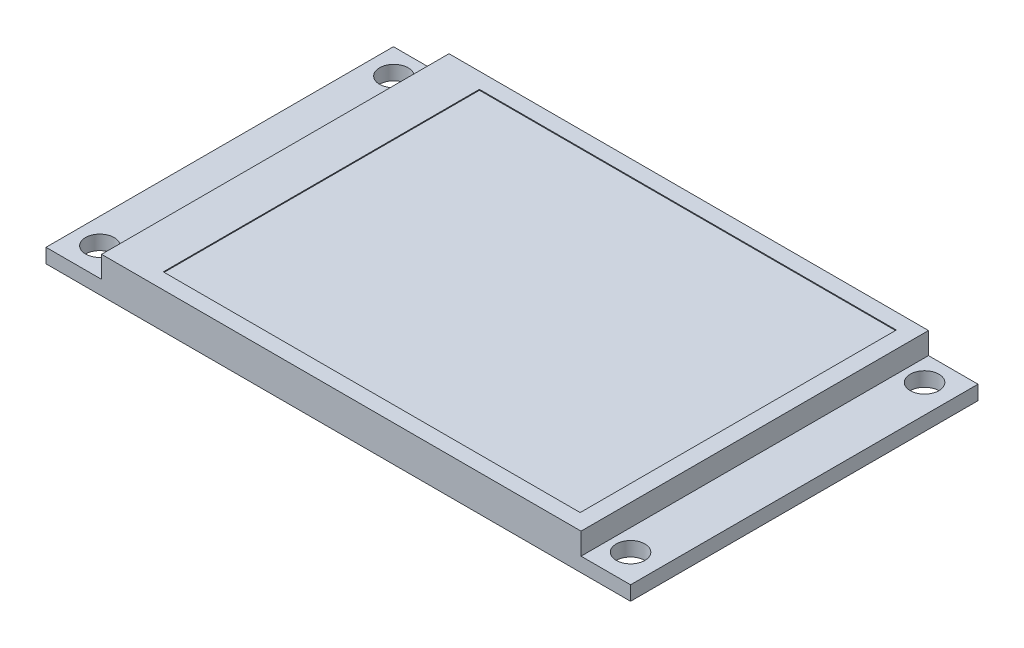
ISO-10303-21;
HEADER;
FILE_DESCRIPTION(('STEP AP214'),'2;1');
FILE_NAME('part.step','',(''),(''),'','','');
FILE_SCHEMA(('AUTOMOTIVE_DESIGN { 1 0 10303 214 1 1 1 1 }'));
ENDSEC;
DATA;
#1=APPLICATION_CONTEXT('core data for automotive mechanical design processes');
#2=APPLICATION_PROTOCOL_DEFINITION('international standard','automotive_design',2000,#1);
#3=PRODUCT_CONTEXT('',#1,'mechanical');
#4=PRODUCT('Part','Part','',(#3));
#5=PRODUCT_RELATED_PRODUCT_CATEGORY('part','',(#4));
#6=PRODUCT_DEFINITION_FORMATION('','',#4);
#7=PRODUCT_DEFINITION_CONTEXT('part definition',#1,'design');
#8=PRODUCT_DEFINITION('design','',#6,#7);
#9=PRODUCT_DEFINITION_SHAPE('','',#8);
#10=(LENGTH_UNIT() NAMED_UNIT(*) SI_UNIT(.MILLI.,.METRE.));
#11=(NAMED_UNIT(*) PLANE_ANGLE_UNIT() SI_UNIT($,.RADIAN.));
#12=(NAMED_UNIT(*) SI_UNIT($,.STERADIAN.) SOLID_ANGLE_UNIT());
#13=UNCERTAINTY_MEASURE_WITH_UNIT(LENGTH_MEASURE(1.E-05),#10,'distance_accuracy_value','');
#14=(GEOMETRIC_REPRESENTATION_CONTEXT(3) GLOBAL_UNCERTAINTY_ASSIGNED_CONTEXT((#13)) GLOBAL_UNIT_ASSIGNED_CONTEXT((#10,
#11,#12)) REPRESENTATION_CONTEXT('',''));
#15=CARTESIAN_POINT('',(0.,0.,0.));
#16=DIRECTION('',(0.,0.,1.));
#17=DIRECTION('',(1.,0.,0.));
#18=AXIS2_PLACEMENT_3D('',#15,#16,#17);
#19=CARTESIAN_POINT('',(0.,1.65,0.));
#20=DIRECTION('',(0.,-1.,0.));
#21=DIRECTION('',(0.,0.,-1.));
#22=AXIS2_PLACEMENT_3D('',#19,#20,#21);
#23=PLANE('',#22);
#24=CARTESIAN_POINT('',(-30.7,1.65,16.75));
#25=DIRECTION('',(0.,1.,0.));
#26=DIRECTION('',(0.,0.,1.));
#27=AXIS2_PLACEMENT_3D('',#24,#25,#26);
#28=CIRCLE('',#27,1.65);
#29=CARTESIAN_POINT('',(-30.7,1.65,18.4));
#30=VERTEX_POINT('',#29);
#31=EDGE_CURVE('E221',#30,#30,#28,.T.);
#32=ORIENTED_EDGE('',*,*,#31,.F.);
#33=EDGE_LOOP('',(#32));
#34=FACE_BOUND('',#33,.T.);
#35=CARTESIAN_POINT('',(-30.7,1.65,-17.1));
#36=DIRECTION('',(0.,1.,0.));
#37=DIRECTION('',(0.,0.,1.));
#38=AXIS2_PLACEMENT_3D('',#35,#36,#37);
#39=CIRCLE('',#38,1.65);
#40=CARTESIAN_POINT('',(-30.7,1.65,-15.45));
#41=VERTEX_POINT('',#40);
#42=EDGE_CURVE('E227',#41,#41,#39,.T.);
#43=ORIENTED_EDGE('',*,*,#42,.F.);
#44=EDGE_LOOP('',(#43));
#45=FACE_BOUND('',#44,.T.);
#46=DIRECTION('',(0.,0.,1.));
#47=VECTOR('',#46,1.);
#48=CARTESIAN_POINT('',(-27.25,1.65,20.));
#49=LINE('',#48,#47);
#50=CARTESIAN_POINT('',(-27.25,1.65,-20.));
#51=VERTEX_POINT('',#50);
#52=CARTESIAN_POINT('',(-27.25,1.65,20.));
#53=VERTEX_POINT('',#52);
#54=EDGE_CURVE('E159',#51,#53,#49,.T.);
#55=ORIENTED_EDGE('',*,*,#54,.F.);
#56=DIRECTION('',(-1.,0.,0.));
#57=VECTOR('',#56,1.);
#58=CARTESIAN_POINT('',(-33.65,1.65,-20.));
#59=LINE('',#58,#57);
#60=CARTESIAN_POINT('',(-33.65,1.65,-20.));
#61=VERTEX_POINT('',#60);
#62=EDGE_CURVE('E236',#51,#61,#59,.T.);
#63=ORIENTED_EDGE('',*,*,#62,.T.);
#64=DIRECTION('',(0.,0.,1.));
#65=VECTOR('',#64,1.);
#66=CARTESIAN_POINT('',(-33.65,1.65,20.));
#67=LINE('',#66,#65);
#68=CARTESIAN_POINT('',(-33.65,1.65,20.));
#69=VERTEX_POINT('',#68);
#70=EDGE_CURVE('E240',#61,#69,#67,.T.);
#71=ORIENTED_EDGE('',*,*,#70,.T.);
#72=DIRECTION('',(1.,0.,0.));
#73=VECTOR('',#72,1.);
#74=CARTESIAN_POINT('',(-33.65,1.65,20.));
#75=LINE('',#74,#73);
#76=EDGE_CURVE('E256',#69,#53,#75,.T.);
#77=ORIENTED_EDGE('',*,*,#76,.T.);
#78=EDGE_LOOP('',(#55,#63,#71,#77));
#79=FACE_BOUND('',#78,.T.);
#80=ADVANCED_FACE('F33',(#34,#45,#79),#23,.F.);
#81=CARTESIAN_POINT('',(30.4,1.65,-17.1));
#82=DIRECTION('',(0.,1.,0.));
#83=DIRECTION('',(0.,0.,1.));
#84=AXIS2_PLACEMENT_3D('',#81,#82,#83);
#85=CIRCLE('',#84,1.65);
#86=CARTESIAN_POINT('',(30.4,1.65,-15.45));
#87=VERTEX_POINT('',#86);
#88=EDGE_CURVE('E208',#87,#87,#85,.T.);
#89=ORIENTED_EDGE('',*,*,#88,.F.);
#90=EDGE_LOOP('',(#89));
#91=FACE_BOUND('',#90,.T.);
#92=CARTESIAN_POINT('',(30.4,1.65,16.75));
#93=DIRECTION('',(0.,1.,0.));
#94=DIRECTION('',(0.,0.,1.));
#95=AXIS2_PLACEMENT_3D('',#92,#93,#94);
#96=CIRCLE('',#95,1.65);
#97=CARTESIAN_POINT('',(30.4,1.65,18.4));
#98=VERTEX_POINT('',#97);
#99=EDGE_CURVE('E215',#98,#98,#96,.T.);
#100=ORIENTED_EDGE('',*,*,#99,.F.);
#101=EDGE_LOOP('',(#100));
#102=FACE_BOUND('',#101,.T.);
#103=DIRECTION('',(0.,0.,-1.));
#104=VECTOR('',#103,1.);
#105=CARTESIAN_POINT('',(27.95,1.65,20.));
#106=LINE('',#105,#104);
#107=CARTESIAN_POINT('',(27.95,1.65,20.));
#108=VERTEX_POINT('',#107);
#109=CARTESIAN_POINT('',(27.95,1.65,-20.));
#110=VERTEX_POINT('',#109);
#111=EDGE_CURVE('E58',#108,#110,#106,.T.);
#112=ORIENTED_EDGE('',*,*,#111,.F.);
#113=CARTESIAN_POINT('',(33.65,1.65,20.));
#114=VERTEX_POINT('',#113);
#115=EDGE_CURVE('E265',#108,#114,#75,.T.);
#116=ORIENTED_EDGE('',*,*,#115,.T.);
#117=DIRECTION('',(0.,0.,-1.));
#118=VECTOR('',#117,1.);
#119=CARTESIAN_POINT('',(33.65,1.65,20.));
#120=LINE('',#119,#118);
#121=CARTESIAN_POINT('',(33.65,1.65,-20.));
#122=VERTEX_POINT('',#121);
#123=EDGE_CURVE('E233',#114,#122,#120,.T.);
#124=ORIENTED_EDGE('',*,*,#123,.T.);
#125=EDGE_CURVE('E246',#122,#110,#59,.T.);
#126=ORIENTED_EDGE('',*,*,#125,.T.);
#127=EDGE_LOOP('',(#112,#116,#124,#126));
#128=FACE_BOUND('',#127,.T.);
#129=ADVANCED_FACE('F291',(#91,#102,#128),#23,.F.);
#130=CARTESIAN_POINT('',(0.,0.,0.));
#131=DIRECTION('',(0.,-1.,0.));
#132=DIRECTION('',(0.,0.,-1.));
#133=AXIS2_PLACEMENT_3D('',#130,#131,#132);
#134=PLANE('',#133);
#135=CARTESIAN_POINT('',(30.4,0.,16.75));
#136=DIRECTION('',(0.,1.,0.));
#137=DIRECTION('',(0.,0.,1.));
#138=AXIS2_PLACEMENT_3D('',#135,#136,#137);
#139=CIRCLE('',#138,1.65);
#140=CARTESIAN_POINT('',(30.4,0.,18.4));
#141=VERTEX_POINT('',#140);
#142=EDGE_CURVE('E213',#141,#141,#139,.T.);
#143=ORIENTED_EDGE('',*,*,#142,.T.);
#144=EDGE_LOOP('',(#143));
#145=FACE_BOUND('',#144,.T.);
#146=CARTESIAN_POINT('',(-30.7,0.,-17.1));
#147=DIRECTION('',(0.,1.,0.));
#148=DIRECTION('',(0.,0.,1.));
#149=AXIS2_PLACEMENT_3D('',#146,#147,#148);
#150=CIRCLE('',#149,1.65);
#151=CARTESIAN_POINT('',(-30.7,0.,-15.45));
#152=VERTEX_POINT('',#151);
#153=EDGE_CURVE('E224',#152,#152,#150,.T.);
#154=ORIENTED_EDGE('',*,*,#153,.T.);
#155=EDGE_LOOP('',(#154));
#156=FACE_BOUND('',#155,.T.);
#157=DIRECTION('',(0.,0.,-1.));
#158=VECTOR('',#157,1.);
#159=CARTESIAN_POINT('',(33.65,0.,20.));
#160=LINE('',#159,#158);
#161=CARTESIAN_POINT('',(33.65,0.,20.));
#162=VERTEX_POINT('',#161);
#163=CARTESIAN_POINT('',(33.65,0.,-20.));
#164=VERTEX_POINT('',#163);
#165=EDGE_CURVE('E230',#162,#164,#160,.T.);
#166=ORIENTED_EDGE('',*,*,#165,.F.);
#167=DIRECTION('',(1.,0.,0.));
#168=VECTOR('',#167,1.);
#169=CARTESIAN_POINT('',(-33.65,0.,20.));
#170=LINE('',#169,#168);
#171=CARTESIAN_POINT('',(-33.65,0.,20.));
#172=VERTEX_POINT('',#171);
#173=EDGE_CURVE('E237',#172,#162,#170,.T.);
#174=ORIENTED_EDGE('',*,*,#173,.F.);
#175=DIRECTION('',(0.,0.,1.));
#176=VECTOR('',#175,1.);
#177=CARTESIAN_POINT('',(-33.65,0.,20.));
#178=LINE('',#177,#176);
#179=CARTESIAN_POINT('',(-33.65,0.,-20.));
#180=VERTEX_POINT('',#179);
#181=EDGE_CURVE('E258',#180,#172,#178,.T.);
#182=ORIENTED_EDGE('',*,*,#181,.F.);
#183=DIRECTION('',(-1.,0.,0.));
#184=VECTOR('',#183,1.);
#185=CARTESIAN_POINT('',(-33.65,0.,-20.));
#186=LINE('',#185,#184);
#187=EDGE_CURVE('E260',#164,#180,#186,.T.);
#188=ORIENTED_EDGE('',*,*,#187,.F.);
#189=EDGE_LOOP('',(#166,#174,#182,#188));
#190=FACE_BOUND('',#189,.T.);
#191=CARTESIAN_POINT('',(-30.7,0.,16.75));
#192=DIRECTION('',(0.,1.,0.));
#193=DIRECTION('',(0.,0.,1.));
#194=AXIS2_PLACEMENT_3D('',#191,#192,#193);
#195=CIRCLE('',#194,1.65);
#196=CARTESIAN_POINT('',(-30.7,0.,18.4));
#197=VERTEX_POINT('',#196);
#198=EDGE_CURVE('E218',#197,#197,#195,.T.);
#199=ORIENTED_EDGE('',*,*,#198,.T.);
#200=EDGE_LOOP('',(#199));
#201=FACE_BOUND('',#200,.T.);
#202=CARTESIAN_POINT('',(30.4,0.,-17.1));
#203=DIRECTION('',(0.,1.,0.));
#204=DIRECTION('',(0.,0.,1.));
#205=AXIS2_PLACEMENT_3D('',#202,#203,#204);
#206=CIRCLE('',#205,1.65);
#207=CARTESIAN_POINT('',(30.4,0.,-15.45));
#208=VERTEX_POINT('',#207);
#209=EDGE_CURVE('E203',#208,#208,#206,.T.);
#210=ORIENTED_EDGE('',*,*,#209,.T.);
#211=EDGE_LOOP('',(#210));
#212=FACE_BOUND('',#211,.T.);
#213=ADVANCED_FACE('F297',(#145,#156,#190,#201,#212),#134,.T.);
#214=CARTESIAN_POINT('',(33.65,1.65,20.));
#215=DIRECTION('',(-1.,0.,0.));
#216=DIRECTION('',(0.,0.,1.));
#217=AXIS2_PLACEMENT_3D('',#214,#215,#216);
#218=PLANE('',#217);
#219=ORIENTED_EDGE('',*,*,#165,.T.);
#220=DIRECTION('',(0.,-1.,0.));
#221=VECTOR('',#220,1.);
#222=CARTESIAN_POINT('',(33.65,1.65,-20.));
#223=LINE('',#222,#221);
#224=EDGE_CURVE('E11',#122,#164,#223,.T.);
#225=ORIENTED_EDGE('',*,*,#224,.F.);
#226=ORIENTED_EDGE('',*,*,#123,.F.);
#227=DIRECTION('',(0.,-1.,0.));
#228=VECTOR('',#227,1.);
#229=CARTESIAN_POINT('',(33.65,1.65,20.));
#230=LINE('',#229,#228);
#231=EDGE_CURVE('E253',#114,#162,#230,.T.);
#232=ORIENTED_EDGE('',*,*,#231,.T.);
#233=EDGE_LOOP('',(#219,#225,#226,#232));
#234=FACE_BOUND('',#233,.T.);
#235=ADVANCED_FACE('F35',(#234),#218,.F.);
#236=CARTESIAN_POINT('',(-33.65,1.65,-20.));
#237=DIRECTION('',(0.,0.,1.));
#238=DIRECTION('',(1.,0.,0.));
#239=AXIS2_PLACEMENT_3D('',#236,#237,#238);
#240=PLANE('',#239);
#241=ORIENTED_EDGE('',*,*,#187,.T.);
#242=DIRECTION('',(0.,-1.,0.));
#243=VECTOR('',#242,1.);
#244=CARTESIAN_POINT('',(-33.65,1.65,-20.));
#245=LINE('',#244,#243);
#246=EDGE_CURVE('E42',#61,#180,#245,.T.);
#247=ORIENTED_EDGE('',*,*,#246,.F.);
#248=ORIENTED_EDGE('',*,*,#62,.F.);
#249=DIRECTION('',(0.,-1.,0.));
#250=VECTOR('',#249,1.);
#251=CARTESIAN_POINT('',(-27.25,4.15,-20.));
#252=LINE('',#251,#250);
#253=CARTESIAN_POINT('',(-27.25,4.15,-20.));
#254=VERTEX_POINT('',#253);
#255=EDGE_CURVE('E172',#254,#51,#252,.T.);
#256=ORIENTED_EDGE('',*,*,#255,.F.);
#257=DIRECTION('',(-1.,0.,0.));
#258=VECTOR('',#257,1.);
#259=CARTESIAN_POINT('',(-27.25,4.15,-20.));
#260=LINE('',#259,#258);
#261=CARTESIAN_POINT('',(27.95,4.15,-20.));
#262=VERTEX_POINT('',#261);
#263=EDGE_CURVE('E170',#262,#254,#260,.T.);
#264=ORIENTED_EDGE('',*,*,#263,.F.);
#265=DIRECTION('',(0.,-1.,0.));
#266=VECTOR('',#265,1.);
#267=CARTESIAN_POINT('',(27.95,4.15,-20.));
#268=LINE('',#267,#266);
#269=EDGE_CURVE('E183',#262,#110,#268,.T.);
#270=ORIENTED_EDGE('',*,*,#269,.T.);
#271=ORIENTED_EDGE('',*,*,#125,.F.);
#272=ORIENTED_EDGE('',*,*,#224,.T.);
#273=EDGE_LOOP('',(#241,#247,#248,#256,#264,#270,#271,#272));
#274=FACE_BOUND('',#273,.T.);
#275=ADVANCED_FACE('F287',(#274),#240,.F.);
#276=CARTESIAN_POINT('',(-33.65,1.65,20.));
#277=DIRECTION('',(1.,0.,0.));
#278=DIRECTION('',(0.,0.,-1.));
#279=AXIS2_PLACEMENT_3D('',#276,#277,#278);
#280=PLANE('',#279);
#281=ORIENTED_EDGE('',*,*,#181,.T.);
#282=DIRECTION('',(0.,-1.,0.));
#283=VECTOR('',#282,1.);
#284=CARTESIAN_POINT('',(-33.65,1.65,20.));
#285=LINE('',#284,#283);
#286=EDGE_CURVE('E250',#69,#172,#285,.T.);
#287=ORIENTED_EDGE('',*,*,#286,.F.);
#288=ORIENTED_EDGE('',*,*,#70,.F.);
#289=ORIENTED_EDGE('',*,*,#246,.T.);
#290=EDGE_LOOP('',(#281,#287,#288,#289));
#291=FACE_BOUND('',#290,.T.);
#292=ADVANCED_FACE('F273',(#291),#280,.F.);
#293=CARTESIAN_POINT('',(-33.65,1.65,20.));
#294=DIRECTION('',(0.,0.,-1.));
#295=DIRECTION('',(-1.,0.,0.));
#296=AXIS2_PLACEMENT_3D('',#293,#294,#295);
#297=PLANE('',#296);
#298=ORIENTED_EDGE('',*,*,#173,.T.);
#299=ORIENTED_EDGE('',*,*,#231,.F.);
#300=ORIENTED_EDGE('',*,*,#115,.F.);
#301=DIRECTION('',(0.,-1.,0.));
#302=VECTOR('',#301,1.);
#303=CARTESIAN_POINT('',(27.95,4.15,20.));
#304=LINE('',#303,#302);
#305=CARTESIAN_POINT('',(27.95,4.15,20.));
#306=VERTEX_POINT('',#305);
#307=EDGE_CURVE('E188',#306,#108,#304,.T.);
#308=ORIENTED_EDGE('',*,*,#307,.F.);
#309=DIRECTION('',(1.,0.,0.));
#310=VECTOR('',#309,1.);
#311=CARTESIAN_POINT('',(-27.25,4.15,20.));
#312=LINE('',#311,#310);
#313=CARTESIAN_POINT('',(-27.25,4.15,20.));
#314=VERTEX_POINT('',#313);
#315=EDGE_CURVE('E166',#314,#306,#312,.T.);
#316=ORIENTED_EDGE('',*,*,#315,.F.);
#317=DIRECTION('',(0.,-1.,0.));
#318=VECTOR('',#317,1.);
#319=CARTESIAN_POINT('',(-27.25,4.15,20.));
#320=LINE('',#319,#318);
#321=EDGE_CURVE('E194',#314,#53,#320,.T.);
#322=ORIENTED_EDGE('',*,*,#321,.T.);
#323=ORIENTED_EDGE('',*,*,#76,.F.);
#324=ORIENTED_EDGE('',*,*,#286,.T.);
#325=EDGE_LOOP('',(#298,#299,#300,#308,#316,#322,#323,#324));
#326=FACE_BOUND('',#325,.T.);
#327=ADVANCED_FACE('F276',(#326),#297,.F.);
#328=CARTESIAN_POINT('',(-30.7,1.65,-17.1));
#329=DIRECTION('',(0.,-1.,0.));
#330=DIRECTION('',(0.,0.,-1.));
#331=AXIS2_PLACEMENT_3D('',#328,#329,#330);
#332=CYLINDRICAL_SURFACE('',#331,1.65);
#333=ORIENTED_EDGE('',*,*,#42,.T.);
#334=EDGE_LOOP('',(#333));
#335=FACE_BOUND('',#334,.T.);
#336=ORIENTED_EDGE('',*,*,#153,.F.);
#337=EDGE_LOOP('',(#336));
#338=FACE_BOUND('',#337,.T.);
#339=ADVANCED_FACE('F278',(#335,#338),#332,.F.);
#340=CARTESIAN_POINT('',(-30.7,1.65,16.75));
#341=DIRECTION('',(0.,-1.,0.));
#342=DIRECTION('',(0.,0.,-1.));
#343=AXIS2_PLACEMENT_3D('',#340,#341,#342);
#344=CYLINDRICAL_SURFACE('',#343,1.65);
#345=ORIENTED_EDGE('',*,*,#31,.T.);
#346=EDGE_LOOP('',(#345));
#347=FACE_BOUND('',#346,.T.);
#348=ORIENTED_EDGE('',*,*,#198,.F.);
#349=EDGE_LOOP('',(#348));
#350=FACE_BOUND('',#349,.T.);
#351=ADVANCED_FACE('F284',(#347,#350),#344,.F.);
#352=CARTESIAN_POINT('',(30.4,1.65,16.75));
#353=DIRECTION('',(0.,-1.,0.));
#354=DIRECTION('',(0.,0.,-1.));
#355=AXIS2_PLACEMENT_3D('',#352,#353,#354);
#356=CYLINDRICAL_SURFACE('',#355,1.65);
#357=ORIENTED_EDGE('',*,*,#99,.T.);
#358=EDGE_LOOP('',(#357));
#359=FACE_BOUND('',#358,.T.);
#360=ORIENTED_EDGE('',*,*,#142,.F.);
#361=EDGE_LOOP('',(#360));
#362=FACE_BOUND('',#361,.T.);
#363=ADVANCED_FACE('F317',(#359,#362),#356,.F.);
#364=CARTESIAN_POINT('',(30.4,1.65,-17.1));
#365=DIRECTION('',(0.,-1.,0.));
#366=DIRECTION('',(0.,0.,-1.));
#367=AXIS2_PLACEMENT_3D('',#364,#365,#366);
#368=CYLINDRICAL_SURFACE('',#367,1.65);
#369=ORIENTED_EDGE('',*,*,#88,.T.);
#370=EDGE_LOOP('',(#369));
#371=FACE_BOUND('',#370,.T.);
#372=ORIENTED_EDGE('',*,*,#209,.F.);
#373=EDGE_LOOP('',(#372));
#374=FACE_BOUND('',#373,.T.);
#375=ADVANCED_FACE('F322',(#371,#374),#368,.F.);
#376=CARTESIAN_POINT('',(-27.25,4.15,20.));
#377=DIRECTION('',(1.,0.,0.));
#378=DIRECTION('',(0.,0.,-1.));
#379=AXIS2_PLACEMENT_3D('',#376,#377,#378);
#380=PLANE('',#379);
#381=ORIENTED_EDGE('',*,*,#54,.T.);
#382=ORIENTED_EDGE('',*,*,#321,.F.);
#383=DIRECTION('',(0.,0.,1.));
#384=VECTOR('',#383,1.);
#385=CARTESIAN_POINT('',(-27.25,4.15,20.));
#386=LINE('',#385,#384);
#387=EDGE_CURVE('E163',#254,#314,#386,.T.);
#388=ORIENTED_EDGE('',*,*,#387,.F.);
#389=ORIENTED_EDGE('',*,*,#255,.T.);
#390=EDGE_LOOP('',(#381,#382,#388,#389));
#391=FACE_BOUND('',#390,.T.);
#392=ADVANCED_FACE('F328',(#391),#380,.F.);
#393=CARTESIAN_POINT('',(27.95,4.15,20.));
#394=DIRECTION('',(-1.,0.,0.));
#395=DIRECTION('',(0.,0.,1.));
#396=AXIS2_PLACEMENT_3D('',#393,#394,#395);
#397=PLANE('',#396);
#398=ORIENTED_EDGE('',*,*,#111,.T.);
#399=ORIENTED_EDGE('',*,*,#269,.F.);
#400=DIRECTION('',(0.,0.,-1.));
#401=VECTOR('',#400,1.);
#402=CARTESIAN_POINT('',(27.95,4.15,20.));
#403=LINE('',#402,#401);
#404=EDGE_CURVE('E168',#306,#262,#403,.T.);
#405=ORIENTED_EDGE('',*,*,#404,.F.);
#406=ORIENTED_EDGE('',*,*,#307,.T.);
#407=EDGE_LOOP('',(#398,#399,#405,#406));
#408=FACE_BOUND('',#407,.T.);
#409=ADVANCED_FACE('F332',(#408),#397,.F.);
#410=CARTESIAN_POINT('',(0.,4.15,0.));
#411=DIRECTION('',(0.,-1.,0.));
#412=DIRECTION('',(0.,0.,-1.));
#413=AXIS2_PLACEMENT_3D('',#410,#411,#412);
#414=PLANE('',#413);
#415=DIRECTION('',(1.,0.,0.));
#416=VECTOR('',#415,1.);
#417=CARTESIAN_POINT('',(-21.95,4.15,18.2));
#418=LINE('',#417,#416);
#419=CARTESIAN_POINT('',(-21.95,4.15,18.2));
#420=VERTEX_POINT('',#419);
#421=CARTESIAN_POINT('',(26.05,4.15,18.2));
#422=VERTEX_POINT('',#421);
#423=EDGE_CURVE('E153',#420,#422,#418,.T.);
#424=ORIENTED_EDGE('',*,*,#423,.F.);
#425=DIRECTION('',(0.,0.,1.));
#426=VECTOR('',#425,1.);
#427=CARTESIAN_POINT('',(-21.95,4.15,-18.2));
#428=LINE('',#427,#426);
#429=CARTESIAN_POINT('',(-21.95,4.15,-18.2));
#430=VERTEX_POINT('',#429);
#431=EDGE_CURVE('E50',#430,#420,#428,.T.);
#432=ORIENTED_EDGE('',*,*,#431,.F.);
#433=DIRECTION('',(-1.,0.,0.));
#434=VECTOR('',#433,1.);
#435=CARTESIAN_POINT('',(-21.95,4.15,-18.2));
#436=LINE('',#435,#434);
#437=CARTESIAN_POINT('',(26.05,4.15,-18.2));
#438=VERTEX_POINT('',#437);
#439=EDGE_CURVE('E144',#438,#430,#436,.T.);
#440=ORIENTED_EDGE('',*,*,#439,.F.);
#441=DIRECTION('',(0.,0.,-1.));
#442=VECTOR('',#441,1.);
#443=CARTESIAN_POINT('',(26.05,4.15,-18.2));
#444=LINE('',#443,#442);
#445=EDGE_CURVE('E147',#422,#438,#444,.T.);
#446=ORIENTED_EDGE('',*,*,#445,.F.);
#447=EDGE_LOOP('',(#424,#432,#440,#446));
#448=FACE_BOUND('',#447,.T.);
#449=ORIENTED_EDGE('',*,*,#387,.T.);
#450=ORIENTED_EDGE('',*,*,#315,.T.);
#451=ORIENTED_EDGE('',*,*,#404,.T.);
#452=ORIENTED_EDGE('',*,*,#263,.T.);
#453=EDGE_LOOP('',(#449,#450,#451,#452));
#454=FACE_BOUND('',#453,.T.);
#455=ADVANCED_FACE('F335',(#448,#454),#414,.F.);
#456=CARTESIAN_POINT('',(-21.95,4.05,-18.2));
#457=DIRECTION('',(-1.,0.,0.));
#458=DIRECTION('',(0.,0.,1.));
#459=AXIS2_PLACEMENT_3D('',#456,#457,#458);
#460=PLANE('',#459);
#461=ORIENTED_EDGE('',*,*,#431,.T.);
#462=DIRECTION('',(0.,1.,0.));
#463=VECTOR('',#462,1.);
#464=CARTESIAN_POINT('',(-21.95,4.05,18.2));
#465=LINE('',#464,#463);
#466=CARTESIAN_POINT('',(-21.95,4.05,18.2));
#467=VERTEX_POINT('',#466);
#468=EDGE_CURVE('E122',#467,#420,#465,.T.);
#469=ORIENTED_EDGE('',*,*,#468,.F.);
#470=DIRECTION('',(0.,0.,1.));
#471=VECTOR('',#470,1.);
#472=CARTESIAN_POINT('',(-21.95,4.05,-18.2));
#473=LINE('',#472,#471);
#474=CARTESIAN_POINT('',(-21.95,4.05,-18.2));
#475=VERTEX_POINT('',#474);
#476=EDGE_CURVE('E126',#475,#467,#473,.T.);
#477=ORIENTED_EDGE('',*,*,#476,.F.);
#478=DIRECTION('',(0.,1.,0.));
#479=VECTOR('',#478,1.);
#480=CARTESIAN_POINT('',(-21.95,4.05,-18.2));
#481=LINE('',#480,#479);
#482=EDGE_CURVE('E157',#475,#430,#481,.T.);
#483=ORIENTED_EDGE('',*,*,#482,.T.);
#484=EDGE_LOOP('',(#461,#469,#477,#483));
#485=FACE_BOUND('',#484,.T.);
#486=ADVANCED_FACE('F124',(#485),#460,.F.);
#487=CARTESIAN_POINT('',(-21.95,4.05,-18.2));
#488=DIRECTION('',(0.,0.,-1.));
#489=DIRECTION('',(-1.,0.,0.));
#490=AXIS2_PLACEMENT_3D('',#487,#488,#489);
#491=PLANE('',#490);
#492=ORIENTED_EDGE('',*,*,#439,.T.);
#493=ORIENTED_EDGE('',*,*,#482,.F.);
#494=DIRECTION('',(-1.,0.,0.));
#495=VECTOR('',#494,1.);
#496=CARTESIAN_POINT('',(-21.95,4.05,-18.2));
#497=LINE('',#496,#495);
#498=CARTESIAN_POINT('',(26.05,4.05,-18.2));
#499=VERTEX_POINT('',#498);
#500=EDGE_CURVE('E132',#499,#475,#497,.T.);
#501=ORIENTED_EDGE('',*,*,#500,.F.);
#502=DIRECTION('',(0.,1.,0.));
#503=VECTOR('',#502,1.);
#504=CARTESIAN_POINT('',(26.05,4.05,-18.2));
#505=LINE('',#504,#503);
#506=EDGE_CURVE('E160',#499,#438,#505,.T.);
#507=ORIENTED_EDGE('',*,*,#506,.T.);
#508=EDGE_LOOP('',(#492,#493,#501,#507));
#509=FACE_BOUND('',#508,.T.);
#510=ADVANCED_FACE('F342',(#509),#491,.F.);
#511=CARTESIAN_POINT('',(26.05,4.05,-18.2));
#512=DIRECTION('',(1.,0.,0.));
#513=DIRECTION('',(0.,0.,-1.));
#514=AXIS2_PLACEMENT_3D('',#511,#512,#513);
#515=PLANE('',#514);
#516=ORIENTED_EDGE('',*,*,#445,.T.);
#517=ORIENTED_EDGE('',*,*,#506,.F.);
#518=DIRECTION('',(0.,0.,-1.));
#519=VECTOR('',#518,1.);
#520=CARTESIAN_POINT('',(26.05,4.05,-18.2));
#521=LINE('',#520,#519);
#522=CARTESIAN_POINT('',(26.05,4.05,18.2));
#523=VERTEX_POINT('',#522);
#524=EDGE_CURVE('E140',#523,#499,#521,.T.);
#525=ORIENTED_EDGE('',*,*,#524,.F.);
#526=DIRECTION('',(0.,1.,0.));
#527=VECTOR('',#526,1.);
#528=CARTESIAN_POINT('',(26.05,4.05,18.2));
#529=LINE('',#528,#527);
#530=EDGE_CURVE('E131',#523,#422,#529,.T.);
#531=ORIENTED_EDGE('',*,*,#530,.T.);
#532=EDGE_LOOP('',(#516,#517,#525,#531));
#533=FACE_BOUND('',#532,.T.);
#534=ADVANCED_FACE('F345',(#533),#515,.F.);
#535=CARTESIAN_POINT('',(-21.95,4.05,18.2));
#536=DIRECTION('',(0.,0.,1.));
#537=DIRECTION('',(1.,0.,0.));
#538=AXIS2_PLACEMENT_3D('',#535,#536,#537);
#539=PLANE('',#538);
#540=ORIENTED_EDGE('',*,*,#423,.T.);
#541=ORIENTED_EDGE('',*,*,#530,.F.);
#542=DIRECTION('',(1.,0.,0.));
#543=VECTOR('',#542,1.);
#544=CARTESIAN_POINT('',(-21.95,4.05,18.2));
#545=LINE('',#544,#543);
#546=EDGE_CURVE('E135',#467,#523,#545,.T.);
#547=ORIENTED_EDGE('',*,*,#546,.F.);
#548=ORIENTED_EDGE('',*,*,#468,.T.);
#549=EDGE_LOOP('',(#540,#541,#547,#548));
#550=FACE_BOUND('',#549,.T.);
#551=ADVANCED_FACE('F136',(#550),#539,.F.);
#552=CARTESIAN_POINT('',(0.,4.05,0.));
#553=DIRECTION('',(0.,1.,0.));
#554=DIRECTION('',(0.,0.,1.));
#555=AXIS2_PLACEMENT_3D('',#552,#553,#554);
#556=PLANE('',#555);
#557=ORIENTED_EDGE('',*,*,#476,.T.);
#558=ORIENTED_EDGE('',*,*,#546,.T.);
#559=ORIENTED_EDGE('',*,*,#524,.T.);
#560=ORIENTED_EDGE('',*,*,#500,.T.);
#561=EDGE_LOOP('',(#557,#558,#559,#560));
#562=FACE_BOUND('',#561,.T.);
#563=ADVANCED_FACE('F142',(#562),#556,.T.);
#564=CLOSED_SHELL('',(#80,#129,#213,#235,#275,#292,#327,#339,#351,#363,#375,#392,#409,#455,#486,
#510,#534,#551,#563));
#565=MANIFOLD_SOLID_BREP('B2',#564);
#566=ADVANCED_BREP_SHAPE_REPRESENTATION('',(#18,#565),#14);
#567=SHAPE_DEFINITION_REPRESENTATION(#9,#566);
ENDSEC;
END-ISO-10303-21;
